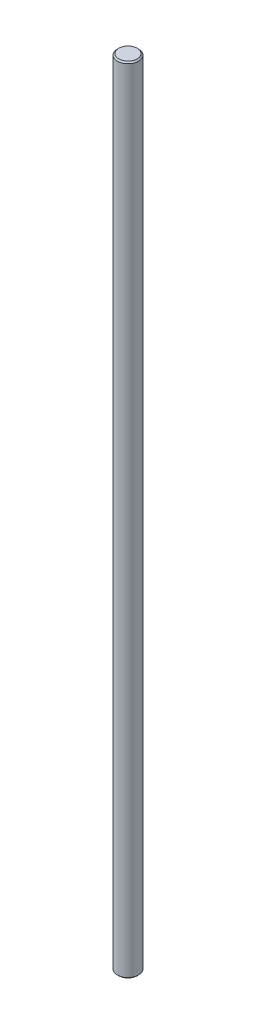
ISO-10303-21;
HEADER;
FILE_DESCRIPTION(('STEP AP214'),'2;1');
FILE_NAME('part.step','',(''),(''),'','','');
FILE_SCHEMA(('AUTOMOTIVE_DESIGN { 1 0 10303 214 1 1 1 1 }'));
ENDSEC;
DATA;
#1=APPLICATION_CONTEXT('core data for automotive mechanical design processes');
#2=APPLICATION_PROTOCOL_DEFINITION('international standard','automotive_design',2000,#1);
#3=PRODUCT_CONTEXT('',#1,'mechanical');
#4=PRODUCT('Part','Part','',(#3));
#5=PRODUCT_RELATED_PRODUCT_CATEGORY('part','',(#4));
#6=PRODUCT_DEFINITION_FORMATION('','',#4);
#7=PRODUCT_DEFINITION_CONTEXT('part definition',#1,'design');
#8=PRODUCT_DEFINITION('design','',#6,#7);
#9=PRODUCT_DEFINITION_SHAPE('','',#8);
#10=(LENGTH_UNIT() NAMED_UNIT(*) SI_UNIT(.MILLI.,.METRE.));
#11=(NAMED_UNIT(*) PLANE_ANGLE_UNIT() SI_UNIT($,.RADIAN.));
#12=(NAMED_UNIT(*) SI_UNIT($,.STERADIAN.) SOLID_ANGLE_UNIT());
#13=UNCERTAINTY_MEASURE_WITH_UNIT(LENGTH_MEASURE(1.E-05),#10,'distance_accuracy_value','');
#14=(GEOMETRIC_REPRESENTATION_CONTEXT(3) GLOBAL_UNCERTAINTY_ASSIGNED_CONTEXT((#13)) GLOBAL_UNIT_ASSIGNED_CONTEXT((#10,
#11,#12)) REPRESENTATION_CONTEXT('',''));
#15=CARTESIAN_POINT('',(0.,0.,0.));
#16=DIRECTION('',(0.,0.,1.));
#17=DIRECTION('',(1.,0.,0.));
#18=AXIS2_PLACEMENT_3D('',#15,#16,#17);
#19=CARTESIAN_POINT('',(0.,-150.,0.));
#20=DIRECTION('',(0.,1.,0.));
#21=DIRECTION('',(0.,0.,1.));
#22=AXIS2_PLACEMENT_3D('',#19,#20,#21);
#23=CYLINDRICAL_SURFACE('',#22,4.);
#24=CARTESIAN_POINT('',(0.,-149.5,0.));
#25=DIRECTION('',(0.,1.,0.));
#26=DIRECTION('',(0.,0.,1.));
#27=AXIS2_PLACEMENT_3D('',#24,#25,#26);
#28=CIRCLE('',#27,4.);
#29=CARTESIAN_POINT('',(0.,-149.5,4.));
#30=VERTEX_POINT('',#29);
#31=EDGE_CURVE('E45',#30,#30,#28,.T.);
#32=ORIENTED_EDGE('',*,*,#31,.T.);
#33=EDGE_LOOP('',(#32));
#34=FACE_BOUND('',#33,.T.);
#35=CARTESIAN_POINT('',(0.,149.5,0.));
#36=DIRECTION('',(0.,1.,0.));
#37=DIRECTION('',(0.,0.,1.));
#38=AXIS2_PLACEMENT_3D('',#35,#36,#37);
#39=CIRCLE('',#38,4.);
#40=CARTESIAN_POINT('',(0.,149.5,4.));
#41=VERTEX_POINT('',#40);
#42=EDGE_CURVE('E49',#41,#41,#39,.F.);
#43=ORIENTED_EDGE('',*,*,#42,.T.);
#44=EDGE_LOOP('',(#43));
#45=FACE_BOUND('',#44,.T.);
#46=ADVANCED_FACE('F33',(#34,#45),#23,.T.);
#47=CARTESIAN_POINT('',(0.,-150.,0.));
#48=DIRECTION('',(0.,1.,0.));
#49=DIRECTION('',(0.,0.,1.));
#50=AXIS2_PLACEMENT_3D('',#47,#48,#49);
#51=PLANE('',#50);
#52=CARTESIAN_POINT('',(0.,-150.,0.));
#53=DIRECTION('',(0.,1.,0.));
#54=DIRECTION('',(0.,0.,1.));
#55=AXIS2_PLACEMENT_3D('',#52,#53,#54);
#56=CIRCLE('',#55,3.50000000000003);
#57=CARTESIAN_POINT('',(0.,-150.,3.50000000000003));
#58=VERTEX_POINT('',#57);
#59=EDGE_CURVE('E41',#58,#58,#56,.F.);
#60=ORIENTED_EDGE('',*,*,#59,.T.);
#61=EDGE_LOOP('',(#60));
#62=FACE_BOUND('',#61,.T.);
#63=ADVANCED_FACE('F65',(#62),#51,.F.);
#64=CARTESIAN_POINT('',(0.,150.,0.));
#65=DIRECTION('',(0.,1.,0.));
#66=DIRECTION('',(0.,0.,1.));
#67=AXIS2_PLACEMENT_3D('',#64,#65,#66);
#68=PLANE('',#67);
#69=CARTESIAN_POINT('',(0.,150.,0.));
#70=DIRECTION('',(0.,1.,0.));
#71=DIRECTION('',(0.,0.,1.));
#72=AXIS2_PLACEMENT_3D('',#69,#70,#71);
#73=CIRCLE('',#72,3.5);
#74=CARTESIAN_POINT('',(0.,150.,3.5));
#75=VERTEX_POINT('',#74);
#76=EDGE_CURVE('E10',#75,#75,#73,.T.);
#77=ORIENTED_EDGE('',*,*,#76,.T.);
#78=EDGE_LOOP('',(#77));
#79=FACE_BOUND('',#78,.T.);
#80=ADVANCED_FACE('F62',(#79),#68,.T.);
#81=CARTESIAN_POINT('',(0.,-149.5,0.));
#82=DIRECTION('',(0.,1.,0.));
#83=DIRECTION('',(0.,0.,1.));
#84=AXIS2_PLACEMENT_3D('',#81,#82,#83);
#85=CONICAL_SURFACE('',#84,4.,0.785398163397445);
#86=ORIENTED_EDGE('',*,*,#59,.F.);
#87=EDGE_LOOP('',(#86));
#88=FACE_BOUND('',#87,.T.);
#89=ORIENTED_EDGE('',*,*,#31,.F.);
#90=EDGE_LOOP('',(#89));
#91=FACE_BOUND('',#90,.T.);
#92=ADVANCED_FACE('F58',(#88,#91),#85,.T.);
#93=CARTESIAN_POINT('',(0.,150.,0.));
#94=DIRECTION('',(0.,-1.,0.));
#95=DIRECTION('',(0.,0.,-1.));
#96=AXIS2_PLACEMENT_3D('',#93,#94,#95);
#97=CONICAL_SURFACE('',#96,3.5,0.785398163397445);
#98=ORIENTED_EDGE('',*,*,#42,.F.);
#99=EDGE_LOOP('',(#98));
#100=FACE_BOUND('',#99,.T.);
#101=ORIENTED_EDGE('',*,*,#76,.F.);
#102=EDGE_LOOP('',(#101));
#103=FACE_BOUND('',#102,.T.);
#104=ADVANCED_FACE('F36',(#100,#103),#97,.T.);
#105=CLOSED_SHELL('',(#46,#63,#80,#92,#104));
#106=MANIFOLD_SOLID_BREP('B2',#105);
#107=ADVANCED_BREP_SHAPE_REPRESENTATION('',(#18,#106),#14);
#108=SHAPE_DEFINITION_REPRESENTATION(#9,#107);
ENDSEC;
END-ISO-10303-21;
